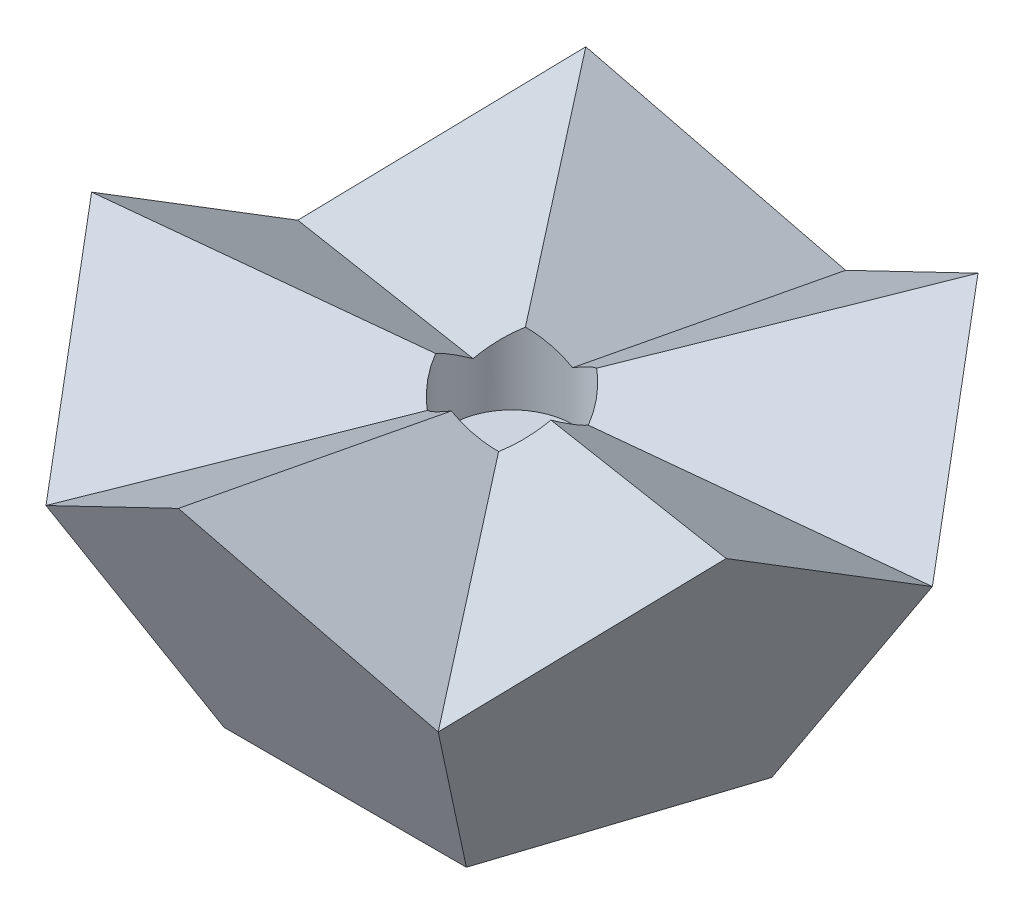
ISO-10303-21;
HEADER;
FILE_DESCRIPTION(('STEP AP214'),'2;1');
FILE_NAME('part.step','',(''),(''),'','','');
FILE_SCHEMA(('AUTOMOTIVE_DESIGN { 1 0 10303 214 1 1 1 1 }'));
ENDSEC;
DATA;
#1=APPLICATION_CONTEXT('core data for automotive mechanical design processes');
#2=APPLICATION_PROTOCOL_DEFINITION('international standard','automotive_design',2000,#1);
#3=PRODUCT_CONTEXT('',#1,'mechanical');
#4=PRODUCT('Part','Part','',(#3));
#5=PRODUCT_RELATED_PRODUCT_CATEGORY('part','',(#4));
#6=PRODUCT_DEFINITION_FORMATION('','',#4);
#7=PRODUCT_DEFINITION_CONTEXT('part definition',#1,'design');
#8=PRODUCT_DEFINITION('design','',#6,#7);
#9=PRODUCT_DEFINITION_SHAPE('','',#8);
#10=(LENGTH_UNIT() NAMED_UNIT(*) SI_UNIT(.MILLI.,.METRE.));
#11=(NAMED_UNIT(*) PLANE_ANGLE_UNIT() SI_UNIT($,.RADIAN.));
#12=(NAMED_UNIT(*) SI_UNIT($,.STERADIAN.) SOLID_ANGLE_UNIT());
#13=UNCERTAINTY_MEASURE_WITH_UNIT(LENGTH_MEASURE(1.E-05),#10,'distance_accuracy_value','');
#14=(GEOMETRIC_REPRESENTATION_CONTEXT(3) GLOBAL_UNCERTAINTY_ASSIGNED_CONTEXT((#13)) GLOBAL_UNIT_ASSIGNED_CONTEXT((#10,
#11,#12)) REPRESENTATION_CONTEXT('',''));
#15=CARTESIAN_POINT('',(0.,0.,0.));
#16=DIRECTION('',(0.,0.,1.));
#17=DIRECTION('',(1.,0.,0.));
#18=AXIS2_PLACEMENT_3D('',#15,#16,#17);
#19=CARTESIAN_POINT('',(0.,0.,0.));
#20=DIRECTION('',(0.,1.,0.));
#21=DIRECTION('',(0.,0.,1.));
#22=AXIS2_PLACEMENT_3D('',#19,#20,#21);
#23=PLANE('',#22);
#24=DIRECTION('',(-0.809016994374948,0.,-0.587785252292473));
#25=VECTOR('',#24,1.);
#26=CARTESIAN_POINT('',(10.2745158285618,0.,-3.3383925619565));
#27=LINE('',#26,#25);
#28=CARTESIAN_POINT('',(10.2745158285618,0.,-3.3383925619565));
#29=VERTEX_POINT('',#28);
#30=CARTESIAN_POINT('',(0.,0.,-10.8032652660709));
#31=VERTEX_POINT('',#30);
#32=EDGE_CURVE('E143',#29,#31,#27,.T.);
#33=ORIENTED_EDGE('',*,*,#32,.F.);
#34=DIRECTION('',(0.309016994374948,0.,-0.951056516295154));
#35=VECTOR('',#34,1.);
#36=CARTESIAN_POINT('',(6.35,0.,8.74002519499195));
#37=LINE('',#36,#35);
#38=CARTESIAN_POINT('',(6.35,0.,8.74002519499195));
#39=VERTEX_POINT('',#38);
#40=EDGE_CURVE('E42',#39,#29,#37,.T.);
#41=ORIENTED_EDGE('',*,*,#40,.F.);
#42=DIRECTION('',(1.,0.,0.));
#43=VECTOR('',#42,1.);
#44=CARTESIAN_POINT('',(-6.35,0.,8.74002519499195));
#45=LINE('',#44,#43);
#46=CARTESIAN_POINT('',(-6.35,0.,8.74002519499195));
#47=VERTEX_POINT('',#46);
#48=EDGE_CURVE('E156',#47,#39,#45,.T.);
#49=ORIENTED_EDGE('',*,*,#48,.F.);
#50=DIRECTION('',(0.309016994374947,0.,0.951056516295154));
#51=VECTOR('',#50,1.);
#52=CARTESIAN_POINT('',(-10.2745158285618,0.,-3.3383925619565));
#53=LINE('',#52,#51);
#54=CARTESIAN_POINT('',(-10.2745158285618,0.,-3.3383925619565));
#55=VERTEX_POINT('',#54);
#56=EDGE_CURVE('E153',#55,#47,#53,.T.);
#57=ORIENTED_EDGE('',*,*,#56,.F.);
#58=DIRECTION('',(-0.809016994374947,0.,0.587785252292473));
#59=VECTOR('',#58,1.);
#60=CARTESIAN_POINT('',(0.,0.,-10.8032652660709));
#61=LINE('',#60,#59);
#62=EDGE_CURVE('E146',#31,#55,#61,.T.);
#63=ORIENTED_EDGE('',*,*,#62,.F.);
#64=EDGE_LOOP('',(#33,#41,#49,#57,#63));
#65=FACE_BOUND('',#64,.T.);
#66=ADVANCED_FACE('F35',(#65),#23,.F.);
#67=CARTESIAN_POINT('',(10.2745158285618,17.4800503899839,-14.1416578280274));
#68=DIRECTION('',(0.309016994374945,0.850650808352039,0.425325404176022));
#69=DIRECTION('',(0.,-0.44721359549996,0.894427190999915));
#70=AXIS2_PLACEMENT_3D('',#67,#68,#69);
#71=PLANE('',#70);
#72=DIRECTION('',(0.577350269189625,0.187592474085084,-0.794654472291766));
#73=VECTOR('',#72,1.);
#74=CARTESIAN_POINT('',(7.65817194285391,16.6299487293989,-10.5405694060037));
#75=LINE('',#74,#73);
#76=CARTESIAN_POINT('',(1.8662181760286,14.7480288708869,-2.56862895714047));
#77=VERTEX_POINT('',#76);
#78=CARTESIAN_POINT('',(10.2745158285618,17.4800503899839,-14.1416578280274));
#79=VERTEX_POINT('',#78);
#80=EDGE_CURVE('E56',#77,#79,#75,.T.);
#81=ORIENTED_EDGE('',*,*,#80,.F.);
#82=CARTESIAN_POINT('',(0.,14.1416578280274,0.));
#83=DIRECTION('',(0.309016994374945,0.850650808352039,0.425325404176022));
#84=DIRECTION('',(-0.499999999999995,0.525731112119134,-0.68819096023559));
#85=AXIS2_PLACEMENT_3D('',#82,#83,#84);
#86=ELLIPSE('',#85,3.73243635205721,3.175);
#87=CARTESIAN_POINT('',(3.01960443923711,13.5352867851678,-0.981128957140458));
#88=VERTEX_POINT('',#87);
#89=EDGE_CURVE('E127',#77,#88,#86,.F.);
#90=ORIENTED_EDGE('',*,*,#89,.T.);
#91=DIRECTION('',(0.934172358962716,-0.187592474085077,-0.303530999103342));
#92=VECTOR('',#91,1.);
#93=CARTESIAN_POINT('',(12.3911824952285,11.6533669266559,-4.02613925231613));
#94=LINE('',#93,#92);
#95=CARTESIAN_POINT('',(16.6245158285618,10.8032652660709,-5.40163263303545));
#96=VERTEX_POINT('',#95);
#97=EDGE_CURVE('E133',#88,#96,#94,.T.);
#98=ORIENTED_EDGE('',*,*,#97,.T.);
#99=DIRECTION('',(0.500000000000001,-0.525731112119134,0.688190960235586));
#100=VECTOR('',#99,1.);
#101=CARTESIAN_POINT('',(10.2745158285618,17.4800503899839,-14.1416578280274));
#102=LINE('',#101,#100);
#103=EDGE_CURVE('E175',#79,#96,#102,.T.);
#104=ORIENTED_EDGE('',*,*,#103,.F.);
#105=EDGE_LOOP('',(#81,#90,#98,#104));
#106=FACE_BOUND('',#105,.T.);
#107=ADVANCED_FACE('F132',(#106),#71,.T.);
#108=CARTESIAN_POINT('',(0.,10.8032652660709,-17.4800503899839));
#109=DIRECTION('',(-0.500000000000002,0.850650808352039,-0.16245984811645));
#110=DIRECTION('',(-0.862103722396975,-0.506731853971388,0.));
#111=AXIS2_PLACEMENT_3D('',#108,#109,#110);
#112=PLANE('',#111);
#113=DIRECTION('',(0.,-0.187592474085077,-0.982246946376847));
#114=VECTOR('',#113,1.);
#115=CARTESIAN_POINT('',(0.,11.6533669266559,-13.0288603073752));
#116=LINE('',#115,#114);
#117=CARTESIAN_POINT('',(0.,13.5352867851678,-3.175));
#118=VERTEX_POINT('',#117);
#119=CARTESIAN_POINT('',(0.,10.8032652660709,-17.4800503899839));
#120=VERTEX_POINT('',#119);
#121=EDGE_CURVE('E148',#118,#120,#116,.T.);
#122=ORIENTED_EDGE('',*,*,#121,.F.);
#123=CARTESIAN_POINT('',(0.,14.1416578280274,0.));
#124=DIRECTION('',(-0.500000000000002,0.850650808352039,-0.16245984811645));
#125=DIRECTION('',(0.809016994374949,0.525731112119135,0.262865556059562));
#126=AXIS2_PLACEMENT_3D('',#123,#124,#125);
#127=ELLIPSE('',#126,3.73243635205721,3.175);
#128=EDGE_CURVE('E396',#118,#77,#127,.F.);
#129=ORIENTED_EDGE('',*,*,#128,.T.);
#130=ORIENTED_EDGE('',*,*,#80,.T.);
#131=DIRECTION('',(0.809016994374946,0.525731112119134,0.262865556059568));
#132=VECTOR('',#131,1.);
#133=CARTESIAN_POINT('',(0.,10.8032652660709,-17.4800503899839));
#134=LINE('',#133,#132);
#135=EDGE_CURVE('E178',#120,#79,#134,.T.);
#136=ORIENTED_EDGE('',*,*,#135,.F.);
#137=EDGE_LOOP('',(#122,#129,#130,#136));
#138=FACE_BOUND('',#137,.T.);
#139=ADVANCED_FACE('F204',(#138),#112,.T.);
#140=CARTESIAN_POINT('',(7.43470949713709,7.81731618442515,-10.2329997358148));
#141=DIRECTION('',(-0.525731112119134,0.447213595499956,0.72360679774998));
#142=DIRECTION('',(0.688190960235586,0.72360679774998,0.0527864045000435));
#143=AXIS2_PLACEMENT_3D('',#140,#141,#142);
#144=PLANE('',#143);
#145=ORIENTED_EDGE('',*,*,#32,.T.);
#146=DIRECTION('',(0.,0.850650808352041,-0.525731112119132));
#147=VECTOR('',#146,1.);
#148=CARTESIAN_POINT('',(0.,0.,-10.8032652660709));
#149=LINE('',#148,#147);
#150=EDGE_CURVE('E186',#31,#120,#149,.T.);
#151=ORIENTED_EDGE('',*,*,#150,.T.);
#152=ORIENTED_EDGE('',*,*,#135,.T.);
#153=ORIENTED_EDGE('',*,*,#103,.T.);
#154=DIRECTION('',(-0.499999999999999,-0.850650808352041,0.162459848116451));
#155=VECTOR('',#154,1.);
#156=CARTESIAN_POINT('',(16.6245158285618,10.8032652660709,-5.40163263303543));
#157=LINE('',#156,#155);
#158=EDGE_CURVE('E163',#96,#29,#157,.T.);
#159=ORIENTED_EDGE('',*,*,#158,.T.);
#160=EDGE_LOOP('',(#145,#151,#152,#153,#159));
#161=FACE_BOUND('',#160,.T.);
#162=ADVANCED_FACE('F173',(#161),#144,.F.);
#163=CARTESIAN_POINT('',(-16.6245158285618,17.4800503899839,5.40163263303544));
#164=DIRECTION('',(0.,0.850650808352039,-0.525731112119135));
#165=DIRECTION('',(0.,0.525731112119135,0.850650808352039));
#166=AXIS2_PLACEMENT_3D('',#163,#164,#165);
#167=PLANE('',#166);
#168=DIRECTION('',(-0.934172358962715,0.187592474085083,0.303530999103342));
#169=VECTOR('',#168,1.);
#170=CARTESIAN_POINT('',(-12.3911824952285,16.6299487293989,4.02613925231613));
#171=LINE('',#170,#169);
#172=CARTESIAN_POINT('',(-3.01960443923711,14.7480288708869,0.981128957140459));
#173=VERTEX_POINT('',#172);
#174=CARTESIAN_POINT('',(-16.6245158285618,17.4800503899839,5.40163263303544));
#175=VERTEX_POINT('',#174);
#176=EDGE_CURVE('E176',#173,#175,#171,.T.);
#177=ORIENTED_EDGE('',*,*,#176,.F.);
#178=CARTESIAN_POINT('',(0.,14.1416578280274,0.));
#179=DIRECTION('',(0.,0.850650808352039,-0.525731112119135));
#180=DIRECTION('',(0.,0.525731112119135,0.850650808352039));
#181=AXIS2_PLACEMENT_3D('',#178,#179,#180);
#182=ELLIPSE('',#181,3.73243635205721,3.175);
#183=CARTESIAN_POINT('',(-3.01960443923711,13.5352867851678,-0.981128957140462));
#184=VERTEX_POINT('',#183);
#185=EDGE_CURVE('E394',#173,#184,#182,.F.);
#186=ORIENTED_EDGE('',*,*,#185,.T.);
#187=DIRECTION('',(-0.934172358962716,-0.187592474085078,-0.303530999103344));
#188=VECTOR('',#187,1.);
#189=CARTESIAN_POINT('',(-12.3911824952285,11.6533669266559,-4.02613925231615));
#190=LINE('',#189,#188);
#191=CARTESIAN_POINT('',(-16.6245158285618,10.8032652660709,-5.40163263303542));
#192=VERTEX_POINT('',#191);
#193=EDGE_CURVE('E363',#184,#192,#190,.T.);
#194=ORIENTED_EDGE('',*,*,#193,.T.);
#195=DIRECTION('',(0.,-0.525731112119135,-0.850650808352039));
#196=VECTOR('',#195,1.);
#197=CARTESIAN_POINT('',(-16.6245158285618,17.4800503899839,5.40163263303544));
#198=LINE('',#197,#196);
#199=EDGE_CURVE('E349',#175,#192,#198,.T.);
#200=ORIENTED_EDGE('',*,*,#199,.F.);
#201=EDGE_LOOP('',(#177,#186,#194,#200));
#202=FACE_BOUND('',#201,.T.);
#203=ADVANCED_FACE('F211',(#202),#167,.T.);
#204=CARTESIAN_POINT('',(-10.2745158285618,10.8032652660709,14.1416578280274));
#205=DIRECTION('',(0.30901699437495,0.85065080835204,0.425325404176019));
#206=DIRECTION('',(0.,-0.447213595499957,0.894427190999916));
#207=AXIS2_PLACEMENT_3D('',#204,#205,#206);
#208=PLANE('',#207);
#209=DIRECTION('',(-0.577350269189626,-0.187592474085077,0.794654472291767));
#210=VECTOR('',#209,1.);
#211=CARTESIAN_POINT('',(-7.65817194285392,11.6533669266559,10.5405694060037));
#212=LINE('',#211,#210);
#213=CARTESIAN_POINT('',(-1.8662181760286,13.5352867851678,2.56862895714046));
#214=VERTEX_POINT('',#213);
#215=CARTESIAN_POINT('',(-10.2745158285618,10.8032652660709,14.1416578280274));
#216=VERTEX_POINT('',#215);
#217=EDGE_CURVE('E180',#214,#216,#212,.T.);
#218=ORIENTED_EDGE('',*,*,#217,.F.);
#219=CARTESIAN_POINT('',(0.,14.1416578280274,0.));
#220=DIRECTION('',(0.30901699437495,0.85065080835204,0.425325404176019));
#221=DIRECTION('',(-0.500000000000004,0.525731112119134,-0.688190960235584));
#222=AXIS2_PLACEMENT_3D('',#219,#220,#221);
#223=ELLIPSE('',#222,3.73243635205721,3.175);
#224=EDGE_CURVE('E392',#214,#173,#223,.F.);
#225=ORIENTED_EDGE('',*,*,#224,.T.);
#226=ORIENTED_EDGE('',*,*,#176,.T.);
#227=DIRECTION('',(-0.499999999999999,0.525731112119134,-0.688190960235587));
#228=VECTOR('',#227,1.);
#229=CARTESIAN_POINT('',(-10.2745158285618,10.8032652660709,14.1416578280274));
#230=LINE('',#229,#228);
#231=EDGE_CURVE('E353',#216,#175,#230,.T.);
#232=ORIENTED_EDGE('',*,*,#231,.F.);
#233=EDGE_LOOP('',(#218,#225,#226,#232));
#234=FACE_BOUND('',#233,.T.);
#235=ADVANCED_FACE('F241',(#234),#208,.T.);
#236=CARTESIAN_POINT('',(-12.0296126628494,7.81731618442515,3.90865809221256));
#237=DIRECTION('',(0.850650808352041,0.447213595499956,-0.276393202250021));
#238=DIRECTION('',(0.425325404176019,-0.276393202250021,0.86180339887499));
#239=AXIS2_PLACEMENT_3D('',#236,#237,#238);
#240=PLANE('',#239);
#241=ORIENTED_EDGE('',*,*,#199,.T.);
#242=DIRECTION('',(0.499999999999998,-0.850650808352041,0.162459848116454));
#243=VECTOR('',#242,1.);
#244=CARTESIAN_POINT('',(-16.6245158285618,10.8032652660709,-5.40163263303547));
#245=LINE('',#244,#243);
#246=EDGE_CURVE('E350',#192,#55,#245,.T.);
#247=ORIENTED_EDGE('',*,*,#246,.T.);
#248=ORIENTED_EDGE('',*,*,#56,.T.);
#249=DIRECTION('',(-0.309016994374946,0.850650808352041,0.425325404176019));
#250=VECTOR('',#249,1.);
#251=CARTESIAN_POINT('',(-6.35,0.,8.74002519499195));
#252=LINE('',#251,#250);
#253=EDGE_CURVE('E357',#47,#216,#252,.T.);
#254=ORIENTED_EDGE('',*,*,#253,.T.);
#255=ORIENTED_EDGE('',*,*,#231,.T.);
#256=EDGE_LOOP('',(#241,#247,#248,#254,#255));
#257=FACE_BOUND('',#256,.T.);
#258=ADVANCED_FACE('F251',(#257),#240,.F.);
#259=CARTESIAN_POINT('',(-10.2745158285618,17.4800503899839,-14.1416578280274));
#260=DIRECTION('',(0.500000000000001,0.85065080835204,-0.162459848116451));
#261=DIRECTION('',(-0.862103722396975,0.506731853971387,0.));
#262=AXIS2_PLACEMENT_3D('',#259,#260,#261);
#263=PLANE('',#262);
#264=DIRECTION('',(-0.577350269189626,0.187592474085083,-0.794654472291765));
#265=VECTOR('',#264,1.);
#266=CARTESIAN_POINT('',(-7.65817194285392,16.6299487293989,-10.5405694060037));
#267=LINE('',#266,#265);
#268=CARTESIAN_POINT('',(-1.8662181760286,14.7480288708869,-2.56862895714046));
#269=VERTEX_POINT('',#268);
#270=CARTESIAN_POINT('',(-10.2745158285618,17.4800503899839,-14.1416578280274));
#271=VERTEX_POINT('',#270);
#272=EDGE_CURVE('E355',#269,#271,#267,.T.);
#273=ORIENTED_EDGE('',*,*,#272,.F.);
#274=CARTESIAN_POINT('',(0.,14.1416578280274,0.));
#275=DIRECTION('',(0.500000000000001,0.85065080835204,-0.162459848116451));
#276=DIRECTION('',(-0.809016994374949,0.525731112119134,0.262865556059563));
#277=AXIS2_PLACEMENT_3D('',#274,#275,#276);
#278=ELLIPSE('',#277,3.7324363520572,3.175);
#279=EDGE_CURVE('E196',#269,#118,#278,.F.);
#280=ORIENTED_EDGE('',*,*,#279,.T.);
#281=ORIENTED_EDGE('',*,*,#121,.T.);
#282=DIRECTION('',(0.809016994374947,-0.525731112119134,-0.262865556059569));
#283=VECTOR('',#282,1.);
#284=CARTESIAN_POINT('',(-10.2745158285618,17.4800503899839,-14.1416578280274));
#285=LINE('',#284,#283);
#286=EDGE_CURVE('E194',#271,#120,#285,.T.);
#287=ORIENTED_EDGE('',*,*,#286,.F.);
#288=EDGE_LOOP('',(#273,#280,#281,#287));
#289=FACE_BOUND('',#288,.T.);
#290=ADVANCED_FACE('F193',(#289),#263,.T.);
#291=CARTESIAN_POINT('',(-16.6245158285618,10.8032652660709,-5.40163263303542));
#292=DIRECTION('',(-0.309016994374945,0.850650808352039,0.425325404176023));
#293=DIRECTION('',(0.,-0.44721359549996,0.894427190999915));
#294=AXIS2_PLACEMENT_3D('',#291,#292,#293);
#295=PLANE('',#294);
#296=ORIENTED_EDGE('',*,*,#193,.F.);
#297=CARTESIAN_POINT('',(0.,14.1416578280274,0.));
#298=DIRECTION('',(-0.309016994374945,0.850650808352039,0.425325404176023));
#299=DIRECTION('',(0.499999999999996,0.525731112119135,-0.688190960235589));
#300=AXIS2_PLACEMENT_3D('',#297,#298,#299);
#301=ELLIPSE('',#300,3.73243635205721,3.175);
#302=EDGE_CURVE('E398',#184,#269,#301,.F.);
#303=ORIENTED_EDGE('',*,*,#302,.T.);
#304=ORIENTED_EDGE('',*,*,#272,.T.);
#305=DIRECTION('',(0.5,0.525731112119135,-0.688190960235586));
#306=VECTOR('',#305,1.);
#307=CARTESIAN_POINT('',(-16.6245158285618,10.8032652660709,-5.40163263303542));
#308=LINE('',#307,#306);
#309=EDGE_CURVE('E201',#192,#271,#308,.T.);
#310=ORIENTED_EDGE('',*,*,#309,.F.);
#311=EDGE_LOOP('',(#296,#303,#304,#310));
#312=FACE_BOUND('',#311,.T.);
#313=ADVANCED_FACE('F263',(#312),#295,.T.);
#314=CARTESIAN_POINT('',(-7.43470949713709,7.81731618442515,-10.2329997358148));
#315=DIRECTION('',(0.525731112119135,0.447213595499956,0.723606797749979));
#316=DIRECTION('',(-0.688190960235586,0.72360679774998,0.0527864045000441));
#317=AXIS2_PLACEMENT_3D('',#314,#315,#316);
#318=PLANE('',#317);
#319=ORIENTED_EDGE('',*,*,#150,.F.);
#320=ORIENTED_EDGE('',*,*,#62,.T.);
#321=ORIENTED_EDGE('',*,*,#246,.F.);
#322=ORIENTED_EDGE('',*,*,#309,.T.);
#323=ORIENTED_EDGE('',*,*,#286,.T.);
#324=EDGE_LOOP('',(#319,#320,#321,#322,#323));
#325=FACE_BOUND('',#324,.T.);
#326=ADVANCED_FACE('F198',(#325),#318,.F.);
#327=CARTESIAN_POINT('',(10.2745158285618,10.8032652660709,14.1416578280274));
#328=DIRECTION('',(0.499999999999999,0.85065080835204,-0.162459848116456));
#329=DIRECTION('',(-0.862103722396976,0.506731853971386,0.));
#330=AXIS2_PLACEMENT_3D('',#327,#328,#329);
#331=PLANE('',#330);
#332=DIRECTION('',(0.577350269189627,-0.187592474085077,0.794654472291766));
#333=VECTOR('',#332,1.);
#334=CARTESIAN_POINT('',(7.65817194285393,11.6533669266559,10.5405694060037));
#335=LINE('',#334,#333);
#336=CARTESIAN_POINT('',(1.86621817602861,13.5352867851678,2.56862895714045));
#337=VERTEX_POINT('',#336);
#338=CARTESIAN_POINT('',(10.2745158285618,10.8032652660709,14.1416578280274));
#339=VERTEX_POINT('',#338);
#340=EDGE_CURVE('E202',#337,#339,#335,.T.);
#341=ORIENTED_EDGE('',*,*,#340,.F.);
#342=CARTESIAN_POINT('',(0.,14.1416578280274,0.));
#343=DIRECTION('',(0.499999999999999,0.85065080835204,-0.162459848116456));
#344=DIRECTION('',(-0.809016994374946,0.525731112119134,0.262865556059571));
#345=AXIS2_PLACEMENT_3D('',#342,#343,#344);
#346=ELLIPSE('',#345,3.73243635205721,3.175);
#347=CARTESIAN_POINT('',(0.,14.7480288708869,3.175));
#348=VERTEX_POINT('',#347);
#349=EDGE_CURVE('E136',#337,#348,#346,.F.);
#350=ORIENTED_EDGE('',*,*,#349,.T.);
#351=DIRECTION('',(0.,0.187592474085083,0.982246946376845));
#352=VECTOR('',#351,1.);
#353=CARTESIAN_POINT('',(0.,16.6299487293989,13.0288603073752));
#354=LINE('',#353,#352);
#355=CARTESIAN_POINT('',(0.,17.4800503899839,17.4800503899839));
#356=VERTEX_POINT('',#355);
#357=EDGE_CURVE('E376',#348,#356,#354,.T.);
#358=ORIENTED_EDGE('',*,*,#357,.T.);
#359=DIRECTION('',(-0.809016994374948,0.525731112119134,0.262865556059566));
#360=VECTOR('',#359,1.);
#361=CARTESIAN_POINT('',(10.2745158285618,10.8032652660709,14.1416578280274));
#362=LINE('',#361,#360);
#363=EDGE_CURVE('E375',#339,#356,#362,.T.);
#364=ORIENTED_EDGE('',*,*,#363,.F.);
#365=EDGE_LOOP('',(#341,#350,#358,#364));
#366=FACE_BOUND('',#365,.T.);
#367=ADVANCED_FACE('F279',(#366),#331,.T.);
#368=CARTESIAN_POINT('',(0.,17.4800503899839,17.4800503899839));
#369=DIRECTION('',(-0.5,0.850650808352039,-0.162459848116456));
#370=DIRECTION('',(-0.862103722396975,-0.506731853971387,0.));
#371=AXIS2_PLACEMENT_3D('',#368,#369,#370);
#372=PLANE('',#371);
#373=ORIENTED_EDGE('',*,*,#357,.F.);
#374=CARTESIAN_POINT('',(0.,14.1416578280274,0.));
#375=DIRECTION('',(-0.5,0.850650808352039,-0.162459848116456));
#376=DIRECTION('',(0.809016994374945,0.525731112119135,0.262865556059571));
#377=AXIS2_PLACEMENT_3D('',#374,#375,#376);
#378=ELLIPSE('',#377,3.73243635205721,3.175);
#379=EDGE_CURVE('E135',#348,#214,#378,.F.);
#380=ORIENTED_EDGE('',*,*,#379,.T.);
#381=ORIENTED_EDGE('',*,*,#217,.T.);
#382=DIRECTION('',(-0.809016994374947,-0.525731112119134,-0.262865556059566));
#383=VECTOR('',#382,1.);
#384=CARTESIAN_POINT('',(0.,17.4800503899839,17.4800503899839));
#385=LINE('',#384,#383);
#386=EDGE_CURVE('E371',#356,#216,#385,.T.);
#387=ORIENTED_EDGE('',*,*,#386,.F.);
#388=EDGE_LOOP('',(#373,#380,#381,#387));
#389=FACE_BOUND('',#388,.T.);
#390=ADVANCED_FACE('F284',(#389),#372,.T.);
#391=CARTESIAN_POINT('',(0.,7.81731618442515,12.6486832872045));
#392=DIRECTION('',(0.,0.447213595499956,-0.894427190999917));
#393=DIRECTION('',(0.,-0.894427190999917,-0.447213595499956));
#394=AXIS2_PLACEMENT_3D('',#391,#392,#393);
#395=PLANE('',#394);
#396=ORIENTED_EDGE('',*,*,#363,.T.);
#397=ORIENTED_EDGE('',*,*,#386,.T.);
#398=ORIENTED_EDGE('',*,*,#253,.F.);
#399=ORIENTED_EDGE('',*,*,#48,.T.);
#400=DIRECTION('',(0.309016994374948,0.850650808352041,0.425325404176018));
#401=VECTOR('',#400,1.);
#402=CARTESIAN_POINT('',(6.35,0.,8.74002519499195));
#403=LINE('',#402,#401);
#404=EDGE_CURVE('E166',#39,#339,#403,.T.);
#405=ORIENTED_EDGE('',*,*,#404,.T.);
#406=EDGE_LOOP('',(#396,#397,#398,#399,#405));
#407=FACE_BOUND('',#406,.T.);
#408=ADVANCED_FACE('F294',(#407),#395,.F.);
#409=CARTESIAN_POINT('',(16.6245158285618,17.4800503899839,5.40163263303544));
#410=DIRECTION('',(-0.30901699437495,0.85065080835204,0.425325404176019));
#411=DIRECTION('',(0.,-0.447213595499957,0.894427190999916));
#412=AXIS2_PLACEMENT_3D('',#409,#410,#411);
#413=PLANE('',#412);
#414=DIRECTION('',(0.934172358962715,0.187592474085083,0.303530999103343));
#415=VECTOR('',#414,1.);
#416=CARTESIAN_POINT('',(12.3911824952285,16.6299487293989,4.02613925231614));
#417=LINE('',#416,#415);
#418=CARTESIAN_POINT('',(3.01960443923711,14.7480288708869,0.981128957140458));
#419=VERTEX_POINT('',#418);
#420=CARTESIAN_POINT('',(16.6245158285618,17.4800503899839,5.40163263303544));
#421=VERTEX_POINT('',#420);
#422=EDGE_CURVE('E379',#419,#421,#417,.T.);
#423=ORIENTED_EDGE('',*,*,#422,.F.);
#424=CARTESIAN_POINT('',(0.,14.1416578280274,0.));
#425=DIRECTION('',(-0.30901699437495,0.85065080835204,0.425325404176019));
#426=DIRECTION('',(0.500000000000003,0.525731112119134,-0.688190960235584));
#427=AXIS2_PLACEMENT_3D('',#424,#425,#426);
#428=ELLIPSE('',#427,3.73243635205721,3.175);
#429=EDGE_CURVE('E49',#419,#337,#428,.F.);
#430=ORIENTED_EDGE('',*,*,#429,.T.);
#431=ORIENTED_EDGE('',*,*,#340,.T.);
#432=DIRECTION('',(-0.499999999999999,-0.525731112119134,0.688190960235587));
#433=VECTOR('',#432,1.);
#434=CARTESIAN_POINT('',(16.6245158285618,17.4800503899839,5.40163263303544));
#435=LINE('',#434,#433);
#436=EDGE_CURVE('E402',#421,#339,#435,.T.);
#437=ORIENTED_EDGE('',*,*,#436,.F.);
#438=EDGE_LOOP('',(#423,#430,#431,#437));
#439=FACE_BOUND('',#438,.T.);
#440=ADVANCED_FACE('F302',(#439),#413,.T.);
#441=CARTESIAN_POINT('',(16.6245158285618,10.8032652660709,-5.40163263303545));
#442=DIRECTION('',(0.,0.85065080835204,-0.525731112119134));
#443=DIRECTION('',(0.,0.525731112119134,0.85065080835204));
#444=AXIS2_PLACEMENT_3D('',#441,#442,#443);
#445=PLANE('',#444);
#446=ORIENTED_EDGE('',*,*,#97,.F.);
#447=CARTESIAN_POINT('',(0.,14.1416578280274,0.));
#448=DIRECTION('',(0.,0.85065080835204,-0.525731112119134));
#449=DIRECTION('',(0.,0.525731112119134,0.85065080835204));
#450=AXIS2_PLACEMENT_3D('',#447,#448,#449);
#451=ELLIPSE('',#450,3.73243635205721,3.175);
#452=EDGE_CURVE('E11',#88,#419,#451,.F.);
#453=ORIENTED_EDGE('',*,*,#452,.T.);
#454=ORIENTED_EDGE('',*,*,#422,.T.);
#455=DIRECTION('',(0.,0.525731112119134,0.85065080835204));
#456=VECTOR('',#455,1.);
#457=CARTESIAN_POINT('',(16.6245158285618,10.8032652660709,-5.40163263303545));
#458=LINE('',#457,#456);
#459=EDGE_CURVE('E141',#96,#421,#458,.T.);
#460=ORIENTED_EDGE('',*,*,#459,.F.);
#461=EDGE_LOOP('',(#446,#453,#454,#460));
#462=FACE_BOUND('',#461,.T.);
#463=ADVANCED_FACE('F139',(#462),#445,.T.);
#464=CARTESIAN_POINT('',(12.0296126628495,7.81731618442515,3.90865809221257));
#465=DIRECTION('',(-0.850650808352041,0.447213595499956,-0.276393202250021));
#466=DIRECTION('',(-0.425325404176019,-0.276393202250021,0.86180339887499));
#467=AXIS2_PLACEMENT_3D('',#464,#465,#466);
#468=PLANE('',#467);
#469=ORIENTED_EDGE('',*,*,#158,.F.);
#470=ORIENTED_EDGE('',*,*,#459,.T.);
#471=ORIENTED_EDGE('',*,*,#436,.T.);
#472=ORIENTED_EDGE('',*,*,#404,.F.);
#473=ORIENTED_EDGE('',*,*,#40,.T.);
#474=EDGE_LOOP('',(#469,#470,#471,#472,#473));
#475=FACE_BOUND('',#474,.T.);
#476=ADVANCED_FACE('F161',(#475),#468,.F.);
#477=CARTESIAN_POINT('',(0.,10.9666578280274,0.));
#478=DIRECTION('',(0.,1.,0.));
#479=DIRECTION('',(0.,0.,1.));
#480=AXIS2_PLACEMENT_3D('',#477,#478,#479);
#481=CYLINDRICAL_SURFACE('',#480,3.175);
#482=ORIENTED_EDGE('',*,*,#302,.F.);
#483=ORIENTED_EDGE('',*,*,#185,.F.);
#484=ORIENTED_EDGE('',*,*,#224,.F.);
#485=ORIENTED_EDGE('',*,*,#379,.F.);
#486=ORIENTED_EDGE('',*,*,#349,.F.);
#487=ORIENTED_EDGE('',*,*,#429,.F.);
#488=ORIENTED_EDGE('',*,*,#452,.F.);
#489=ORIENTED_EDGE('',*,*,#89,.F.);
#490=ORIENTED_EDGE('',*,*,#128,.F.);
#491=ORIENTED_EDGE('',*,*,#279,.F.);
#492=EDGE_LOOP('',(#482,#483,#484,#485,#486,#487,#488,#489,#490,#491));
#493=FACE_BOUND('',#492,.T.);
#494=CARTESIAN_POINT('',(0.,10.9666578280274,0.));
#495=DIRECTION('',(0.,-1.,0.));
#496=DIRECTION('',(0.,0.,-1.));
#497=AXIS2_PLACEMENT_3D('',#494,#495,#496);
#498=CIRCLE('',#497,3.175);
#499=CARTESIAN_POINT('',(0.,10.9666578280274,-3.175));
#500=VERTEX_POINT('',#499);
#501=EDGE_CURVE('E387',#500,#500,#498,.T.);
#502=ORIENTED_EDGE('',*,*,#501,.T.);
#503=EDGE_LOOP('',(#502));
#504=FACE_BOUND('',#503,.T.);
#505=ADVANCED_FACE('F125',(#493,#504),#481,.F.);
#506=CARTESIAN_POINT('',(0.,10.9666578280274,0.));
#507=DIRECTION('',(0.,-1.,0.));
#508=DIRECTION('',(0.,0.,-1.));
#509=AXIS2_PLACEMENT_3D('',#506,#507,#508);
#510=PLANE('',#509);
#511=ORIENTED_EDGE('',*,*,#501,.F.);
#512=EDGE_LOOP('',(#511));
#513=FACE_BOUND('',#512,.T.);
#514=ADVANCED_FACE('F324',(#513),#510,.F.);
#515=CLOSED_SHELL('',(#66,#107,#139,#162,#203,#235,#258,#290,#313,#326,#367,#390,#408,#440,#463,
#476,#505,#514));
#516=MANIFOLD_SOLID_BREP('B2',#515);
#517=ADVANCED_BREP_SHAPE_REPRESENTATION('',(#18,#516),#14);
#518=SHAPE_DEFINITION_REPRESENTATION(#9,#517);
ENDSEC;
END-ISO-10303-21;
